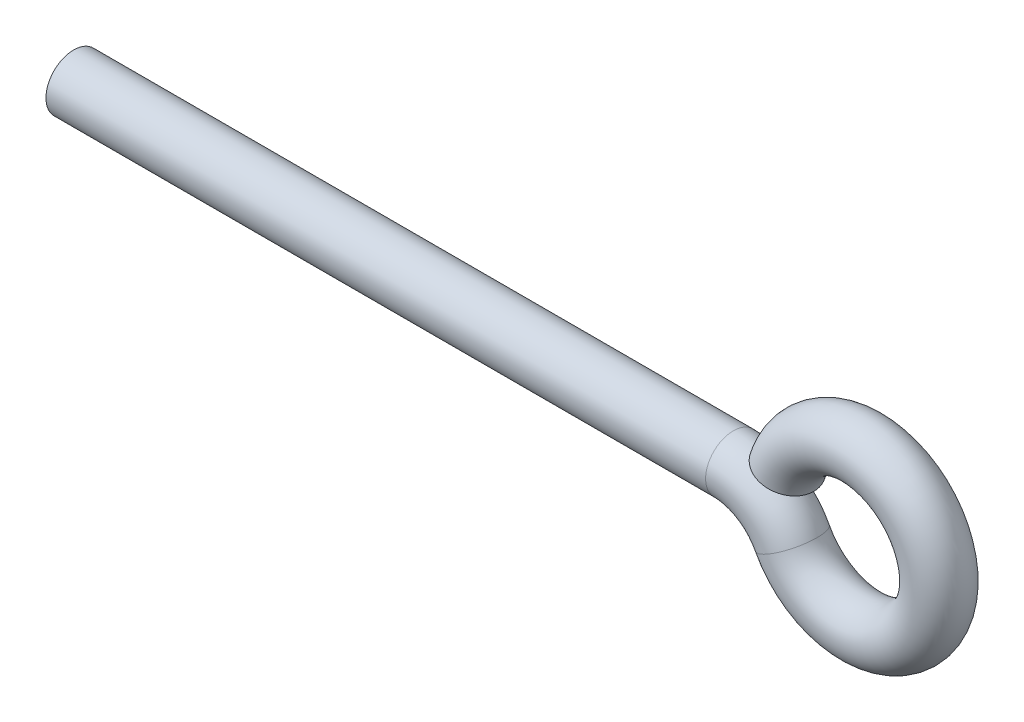
ISO-10303-21;
HEADER;
FILE_DESCRIPTION(('STEP AP214'),'2;1');
FILE_NAME('part.step','',(''),(''),'','','');
FILE_SCHEMA(('AUTOMOTIVE_DESIGN { 1 0 10303 214 1 1 1 1 }'));
ENDSEC;
DATA;
#1=APPLICATION_CONTEXT('core data for automotive mechanical design processes');
#2=APPLICATION_PROTOCOL_DEFINITION('international standard','automotive_design',2000,#1);
#3=PRODUCT_CONTEXT('',#1,'mechanical');
#4=PRODUCT('Part','Part','',(#3));
#5=PRODUCT_RELATED_PRODUCT_CATEGORY('part','',(#4));
#6=PRODUCT_DEFINITION_FORMATION('','',#4);
#7=PRODUCT_DEFINITION_CONTEXT('part definition',#1,'design');
#8=PRODUCT_DEFINITION('design','',#6,#7);
#9=PRODUCT_DEFINITION_SHAPE('','',#8);
#10=(LENGTH_UNIT() NAMED_UNIT(*) SI_UNIT(.MILLI.,.METRE.));
#11=(NAMED_UNIT(*) PLANE_ANGLE_UNIT() SI_UNIT($,.RADIAN.));
#12=(NAMED_UNIT(*) SI_UNIT($,.STERADIAN.) SOLID_ANGLE_UNIT());
#13=UNCERTAINTY_MEASURE_WITH_UNIT(LENGTH_MEASURE(1.E-05),#10,'distance_accuracy_value','');
#14=(GEOMETRIC_REPRESENTATION_CONTEXT(3) GLOBAL_UNCERTAINTY_ASSIGNED_CONTEXT((#13)) GLOBAL_UNIT_ASSIGNED_CONTEXT((#10,
#11,#12)) REPRESENTATION_CONTEXT('',''));
#15=CARTESIAN_POINT('',(0.,0.,0.));
#16=DIRECTION('',(0.,0.,1.));
#17=DIRECTION('',(1.,0.,0.));
#18=AXIS2_PLACEMENT_3D('',#15,#16,#17);
#19=CARTESIAN_POINT('',(-41.5,0.,0.));
#20=DIRECTION('',(1.,0.,0.));
#21=DIRECTION('',(0.,0.,-1.));
#22=AXIS2_PLACEMENT_3D('',#19,#20,#21);
#23=PLANE('',#22);
#24=CARTESIAN_POINT('',(-41.5,0.,0.));
#25=DIRECTION('',(1.,0.,0.));
#26=DIRECTION('',(0.,0.,-1.));
#27=AXIS2_PLACEMENT_3D('',#24,#25,#26);
#28=CIRCLE('',#27,1.25);
#29=CARTESIAN_POINT('',(-41.5,0.,-1.25));
#30=VERTEX_POINT('',#29);
#31=EDGE_CURVE('E58',#30,#30,#28,.T.);
#32=ORIENTED_EDGE('',*,*,#31,.F.);
#33=EDGE_LOOP('',(#32));
#34=FACE_BOUND('',#33,.T.);
#35=ADVANCED_FACE('F44',(#34),#23,.F.);
#36=CARTESIAN_POINT('',(-9.32869780703304,1.08155948031229,0.));
#37=DIRECTION('',(-0.309016994374941,-0.951056516295156,0.));
#38=DIRECTION('',(0.,0.,-1.));
#39=AXIS2_PLACEMENT_3D('',#36,#37,#38);
#40=PLANE('',#39);
#41=CARTESIAN_POINT('',(-9.32869780703304,1.08155948031229,0.));
#42=DIRECTION('',(-0.309016994374941,-0.951056516295156,0.));
#43=DIRECTION('',(0.,0.,-1.));
#44=AXIS2_PLACEMENT_3D('',#41,#42,#43);
#45=CIRCLE('',#44,1.25);
#46=CARTESIAN_POINT('',(-9.32869780703304,1.08155948031229,-1.25));
#47=VERTEX_POINT('',#46);
#48=EDGE_CURVE('E11',#47,#47,#45,.T.);
#49=ORIENTED_EDGE('',*,*,#48,.T.);
#50=EDGE_LOOP('',(#49));
#51=FACE_BOUND('',#50,.T.);
#52=ADVANCED_FACE('F67',(#51),#40,.T.);
#53=CARTESIAN_POINT('',(-41.5,0.,0.));
#54=DIRECTION('',(1.,0.,0.));
#55=DIRECTION('',(0.,0.,-1.));
#56=AXIS2_PLACEMENT_3D('',#53,#54,#55);
#57=CYLINDRICAL_SURFACE('',#56,1.25);
#58=CARTESIAN_POINT('',(-11.7662812973354,0.,0.));
#59=DIRECTION('',(1.,0.,0.));
#60=DIRECTION('',(0.,0.,-1.));
#61=AXIS2_PLACEMENT_3D('',#58,#59,#60);
#62=CIRCLE('',#61,1.25);
#63=CARTESIAN_POINT('',(-11.7662812973354,1.25,0.));
#64=VERTEX_POINT('',#63);
#65=EDGE_CURVE('E54',#64,#64,#62,.T.);
#66=ORIENTED_EDGE('',*,*,#65,.F.);
#67=EDGE_LOOP('',(#66));
#68=FACE_BOUND('',#67,.T.);
#69=ORIENTED_EDGE('',*,*,#31,.T.);
#70=EDGE_LOOP('',(#69));
#71=FACE_BOUND('',#70,.T.);
#72=ADVANCED_FACE('F64',(#68,#71),#57,.T.);
#73=CARTESIAN_POINT('',(-11.7662812973354,-3.,0.));
#74=DIRECTION('',(0.,0.,-1.));
#75=DIRECTION('',(-1.,0.,0.));
#76=AXIS2_PLACEMENT_3D('',#73,#74,#75);
#77=TOROIDAL_SURFACE('',#76,3.,1.25);
#78=CARTESIAN_POINT('',(-9.10492069856521,-1.61538461538462,0.));
#79=DIRECTION('',(0.461538461538462,-0.887120199590061,0.));
#80=DIRECTION('',(0.,0.,-1.));
#81=AXIS2_PLACEMENT_3D('',#78,#79,#80);
#82=CIRCLE('',#81,1.25);
#83=CARTESIAN_POINT('',(-7.99602044907764,-1.03846153846154,0.));
#84=VERTEX_POINT('',#83);
#85=EDGE_CURVE('E50',#84,#84,#82,.T.);
#86=CARTESIAN_POINT('',(-11.7662812973354,-3.,0.));
#87=DIRECTION('',(0.,0.,-1.));
#88=DIRECTION('',(-1.,0.,0.));
#89=AXIS2_PLACEMENT_3D('',#86,#87,#88);
#90=CIRCLE('',#89,4.25);
#91=EDGE_CURVE('',#64,#84,#90,.T.);
#92=ORIENTED_EDGE('',*,*,#65,.T.);
#93=ORIENTED_EDGE('',*,*,#85,.F.);
#94=ORIENTED_EDGE('',*,*,#91,.T.);
#95=ORIENTED_EDGE('',*,*,#91,.F.);
#96=EDGE_LOOP('',(#92,#94,#93,#95));
#97=FACE_BOUND('',#96,.T.);
#98=ADVANCED_FACE('F73',(#97),#77,.T.);
#99=CARTESIAN_POINT('',(-6.,0.,0.));
#100=DIRECTION('',(0.,0.,1.));
#101=DIRECTION('',(1.,0.,0.));
#102=AXIS2_PLACEMENT_3D('',#99,#100,#101);
#103=TOROIDAL_SURFACE('',#102,3.5,1.25);
#104=ORIENTED_EDGE('',*,*,#48,.F.);
#105=EDGE_LOOP('',(#104));
#106=FACE_BOUND('',#105,.T.);
#107=ORIENTED_EDGE('',*,*,#85,.T.);
#108=EDGE_LOOP('',(#107));
#109=FACE_BOUND('',#108,.T.);
#110=ADVANCED_FACE('F71',(#106,#109),#103,.T.);
#111=CLOSED_SHELL('',(#35,#52,#72,#98,#110));
#112=MANIFOLD_SOLID_BREP('B2',#111);
#113=ADVANCED_BREP_SHAPE_REPRESENTATION('',(#18,#112),#14);
#114=SHAPE_DEFINITION_REPRESENTATION(#9,#113);
ENDSEC;
END-ISO-10303-21;
